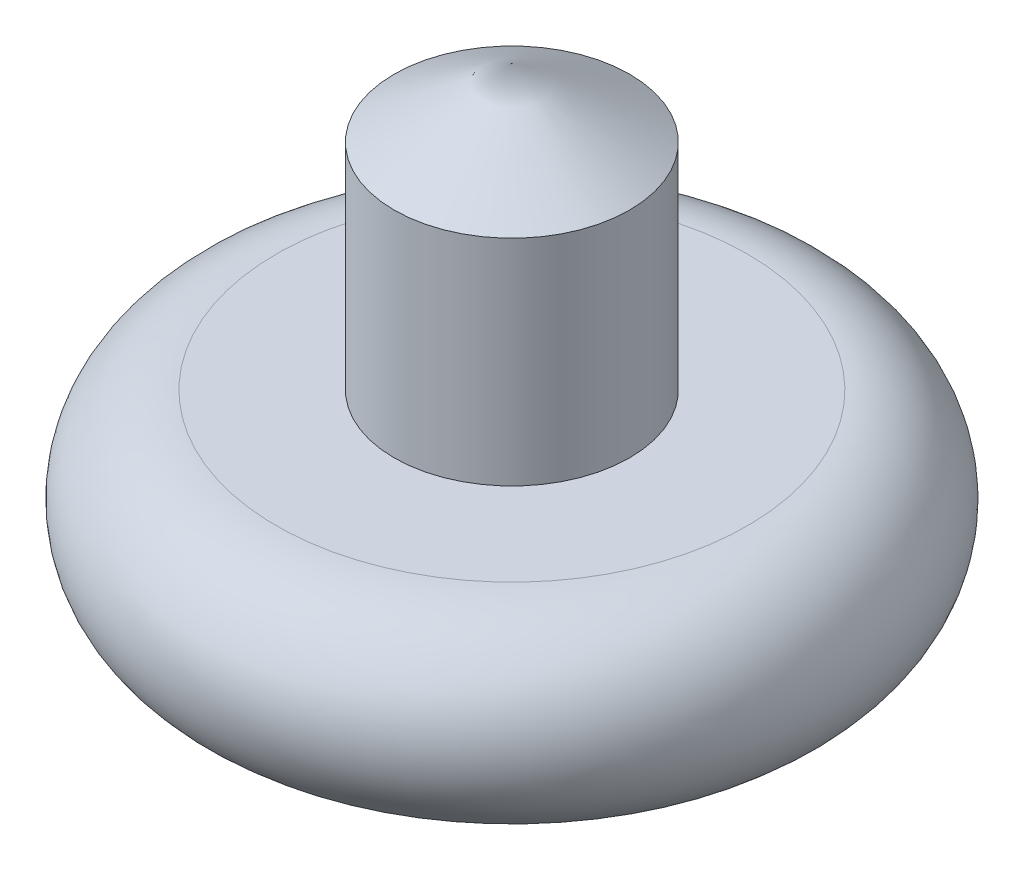
ISO-10303-21;
HEADER;
FILE_DESCRIPTION(('STEP AP214'),'2;1');
FILE_NAME('part.step','',(''),(''),'','','');
FILE_SCHEMA(('AUTOMOTIVE_DESIGN { 1 0 10303 214 1 1 1 1 }'));
ENDSEC;
DATA;
#1=APPLICATION_CONTEXT('core data for automotive mechanical design processes');
#2=APPLICATION_PROTOCOL_DEFINITION('international standard','automotive_design',2000,#1);
#3=PRODUCT_CONTEXT('',#1,'mechanical');
#4=PRODUCT('Part','Part','',(#3));
#5=PRODUCT_RELATED_PRODUCT_CATEGORY('part','',(#4));
#6=PRODUCT_DEFINITION_FORMATION('','',#4);
#7=PRODUCT_DEFINITION_CONTEXT('part definition',#1,'design');
#8=PRODUCT_DEFINITION('design','',#6,#7);
#9=PRODUCT_DEFINITION_SHAPE('','',#8);
#10=(LENGTH_UNIT() NAMED_UNIT(*) SI_UNIT(.MILLI.,.METRE.));
#11=(NAMED_UNIT(*) PLANE_ANGLE_UNIT() SI_UNIT($,.RADIAN.));
#12=(NAMED_UNIT(*) SI_UNIT($,.STERADIAN.) SOLID_ANGLE_UNIT());
#13=UNCERTAINTY_MEASURE_WITH_UNIT(LENGTH_MEASURE(1.E-05),#10,'distance_accuracy_value','');
#14=(GEOMETRIC_REPRESENTATION_CONTEXT(3) GLOBAL_UNCERTAINTY_ASSIGNED_CONTEXT((#13)) GLOBAL_UNIT_ASSIGNED_CONTEXT((#10,
#11,#12)) REPRESENTATION_CONTEXT('',''));
#15=CARTESIAN_POINT('',(0.,0.,0.));
#16=DIRECTION('',(0.,0.,1.));
#17=DIRECTION('',(1.,0.,0.));
#18=AXIS2_PLACEMENT_3D('',#15,#16,#17);
#19=CARTESIAN_POINT('',(0.,0.,0.));
#20=DIRECTION('',(0.,-1.,0.));
#21=DIRECTION('',(0.,0.,-1.));
#22=AXIS2_PLACEMENT_3D('',#19,#20,#21);
#23=PLANE('',#22);
#24=CARTESIAN_POINT('',(0.,0.,0.));
#25=DIRECTION('',(0.,-1.,0.));
#26=DIRECTION('',(0.,0.,-1.));
#27=AXIS2_PLACEMENT_3D('',#24,#25,#26);
#28=CIRCLE('',#27,100.);
#29=CARTESIAN_POINT('',(0.,0.,-100.));
#30=VERTEX_POINT('',#29);
#31=EDGE_CURVE('E11',#30,#30,#28,.T.);
#32=ORIENTED_EDGE('',*,*,#31,.T.);
#33=EDGE_LOOP('',(#32));
#34=FACE_BOUND('',#33,.T.);
#35=ADVANCED_FACE('F43',(#34),#23,.T.);
#36=CARTESIAN_POINT('',(0.,40.,0.));
#37=DIRECTION('',(0.,-1.,0.));
#38=DIRECTION('',(0.,0.,-1.));
#39=AXIS2_PLACEMENT_3D('',#36,#37,#38);
#40=TOROIDAL_SURFACE('',#39,100.,40.);
#41=CARTESIAN_POINT('',(0.,80.,0.));
#42=DIRECTION('',(0.,-1.,0.));
#43=DIRECTION('',(0.,0.,-1.));
#44=AXIS2_PLACEMENT_3D('',#41,#42,#43);
#45=CIRCLE('',#44,100.);
#46=CARTESIAN_POINT('',(0.,80.,-100.));
#47=VERTEX_POINT('',#46);
#48=EDGE_CURVE('E50',#47,#47,#45,.T.);
#49=ORIENTED_EDGE('',*,*,#48,.T.);
#50=EDGE_LOOP('',(#49));
#51=FACE_BOUND('',#50,.T.);
#52=ORIENTED_EDGE('',*,*,#31,.F.);
#53=EDGE_LOOP('',(#52));
#54=FACE_BOUND('',#53,.T.);
#55=ADVANCED_FACE('F72',(#51,#54),#40,.T.);
#56=CARTESIAN_POINT('',(100.,80.,0.));
#57=DIRECTION('',(0.,1.,0.));
#58=DIRECTION('',(0.,0.,1.));
#59=AXIS2_PLACEMENT_3D('',#56,#57,#58);
#60=PLANE('',#59);
#61=CARTESIAN_POINT('',(0.,80.,0.));
#62=DIRECTION('',(0.,-1.,0.));
#63=DIRECTION('',(0.,0.,-1.));
#64=AXIS2_PLACEMENT_3D('',#61,#62,#63);
#65=CIRCLE('',#64,50.);
#66=CARTESIAN_POINT('',(0.,80.,-50.));
#67=VERTEX_POINT('',#66);
#68=EDGE_CURVE('E63',#67,#67,#65,.T.);
#69=ORIENTED_EDGE('',*,*,#68,.T.);
#70=EDGE_LOOP('',(#69));
#71=FACE_BOUND('',#70,.T.);
#72=ORIENTED_EDGE('',*,*,#48,.F.);
#73=EDGE_LOOP('',(#72));
#74=FACE_BOUND('',#73,.T.);
#75=ADVANCED_FACE('F75',(#71,#74),#60,.T.);
#76=CARTESIAN_POINT('',(0.,0.,0.));
#77=DIRECTION('',(0.,-1.,0.));
#78=DIRECTION('',(0.,0.,-1.));
#79=AXIS2_PLACEMENT_3D('',#76,#77,#78);
#80=CYLINDRICAL_SURFACE('',#79,50.);
#81=CARTESIAN_POINT('',(0.,171.132486540519,0.));
#82=DIRECTION('',(0.,-1.,0.));
#83=DIRECTION('',(0.,0.,-1.));
#84=AXIS2_PLACEMENT_3D('',#81,#82,#83);
#85=CIRCLE('',#84,50.);
#86=CARTESIAN_POINT('',(0.,171.132486540519,-50.));
#87=VERTEX_POINT('',#86);
#88=EDGE_CURVE('E60',#87,#87,#85,.T.);
#89=ORIENTED_EDGE('',*,*,#88,.T.);
#90=EDGE_LOOP('',(#89));
#91=FACE_BOUND('',#90,.T.);
#92=ORIENTED_EDGE('',*,*,#68,.F.);
#93=EDGE_LOOP('',(#92));
#94=FACE_BOUND('',#93,.T.);
#95=ADVANCED_FACE('F56',(#91,#94),#80,.T.);
#96=CARTESIAN_POINT('',(0.,171.132486540519,0.));
#97=DIRECTION('',(0.,-1.,0.));
#98=DIRECTION('',(0.,0.,-1.));
#99=AXIS2_PLACEMENT_3D('',#96,#97,#98);
#100=CONICAL_SURFACE('',#99,50.,1.0471975511966);
#101=CARTESIAN_POINT('',(0.,200.,0.));
#102=VERTEX_POINT('',#101);
#103=VERTEX_LOOP('',#102);
#104=FACE_BOUND('',#103,.T.);
#105=ORIENTED_EDGE('',*,*,#88,.F.);
#106=EDGE_LOOP('',(#105));
#107=FACE_BOUND('',#106,.T.);
#108=ADVANCED_FACE('F53',(#104,#107),#100,.T.);
#109=CLOSED_SHELL('',(#35,#55,#75,#95,#108));
#110=MANIFOLD_SOLID_BREP('B2',#109);
#111=ADVANCED_BREP_SHAPE_REPRESENTATION('',(#18,#110),#14);
#112=SHAPE_DEFINITION_REPRESENTATION(#9,#111);
ENDSEC;
END-ISO-10303-21;
